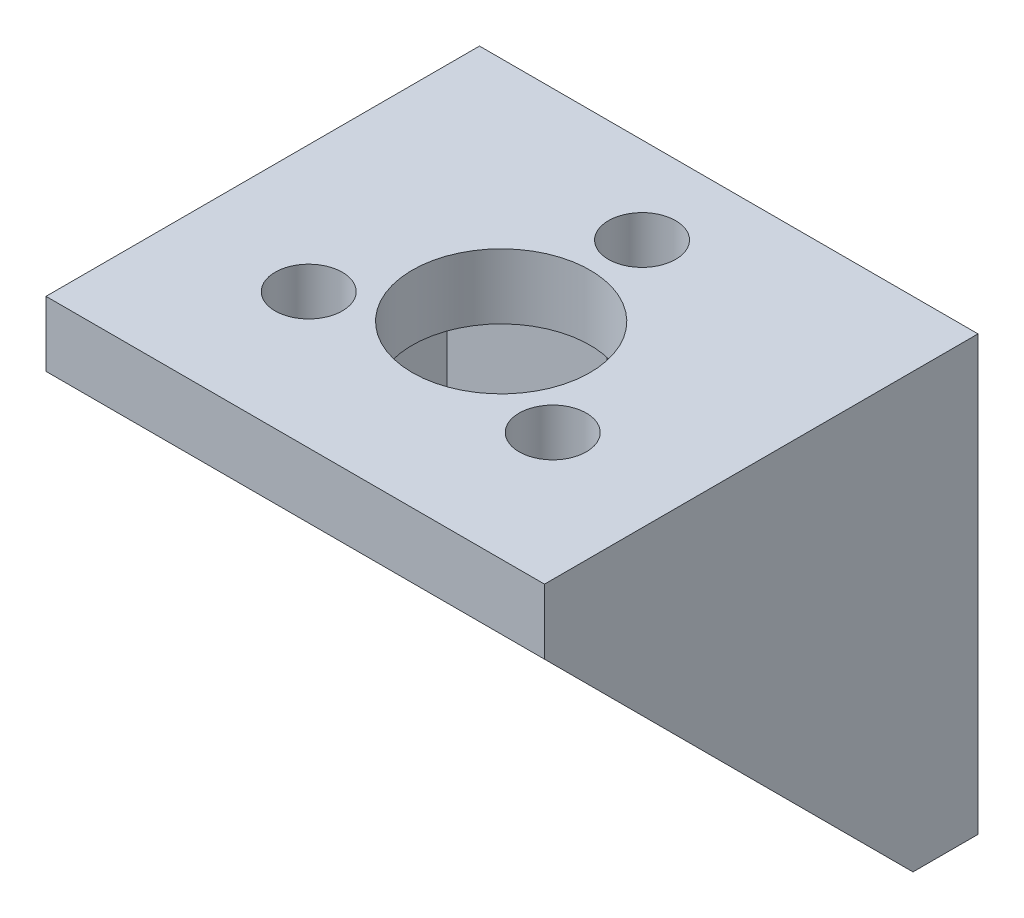
ISO-10303-21;
HEADER;
FILE_DESCRIPTION(('STEP AP214'),'2;1');
FILE_NAME('part.step','',(''),(''),'','','');
FILE_SCHEMA(('AUTOMOTIVE_DESIGN { 1 0 10303 214 1 1 1 1 }'));
ENDSEC;
DATA;
#1=APPLICATION_CONTEXT('core data for automotive mechanical design processes');
#2=APPLICATION_PROTOCOL_DEFINITION('international standard','automotive_design',2000,#1);
#3=PRODUCT_CONTEXT('',#1,'mechanical');
#4=PRODUCT('Part','Part','',(#3));
#5=PRODUCT_RELATED_PRODUCT_CATEGORY('part','',(#4));
#6=PRODUCT_DEFINITION_FORMATION('','',#4);
#7=PRODUCT_DEFINITION_CONTEXT('part definition',#1,'design');
#8=PRODUCT_DEFINITION('design','',#6,#7);
#9=PRODUCT_DEFINITION_SHAPE('','',#8);
#10=(LENGTH_UNIT() NAMED_UNIT(*) SI_UNIT(.MILLI.,.METRE.));
#11=(NAMED_UNIT(*) PLANE_ANGLE_UNIT() SI_UNIT($,.RADIAN.));
#12=(NAMED_UNIT(*) SI_UNIT($,.STERADIAN.) SOLID_ANGLE_UNIT());
#13=UNCERTAINTY_MEASURE_WITH_UNIT(LENGTH_MEASURE(1.E-05),#10,'distance_accuracy_value','');
#14=(GEOMETRIC_REPRESENTATION_CONTEXT(3) GLOBAL_UNCERTAINTY_ASSIGNED_CONTEXT((#13)) GLOBAL_UNIT_ASSIGNED_CONTEXT((#10,
#11,#12)) REPRESENTATION_CONTEXT('',''));
#15=CARTESIAN_POINT('',(0.,0.,0.));
#16=DIRECTION('',(0.,0.,1.));
#17=DIRECTION('',(1.,0.,0.));
#18=AXIS2_PLACEMENT_3D('',#15,#16,#17);
#19=CARTESIAN_POINT('',(-10.,-3.,2.99999999999999));
#20=DIRECTION('',(0.,0.,-1.));
#21=DIRECTION('',(0.,1.,0.));
#22=AXIS2_PLACEMENT_3D('',#19,#20,#21);
#23=PLANE('',#22);
#24=DIRECTION('',(0.,1.,0.));
#25=VECTOR('',#24,1.);
#26=CARTESIAN_POINT('',(-2.61533936612726,-20.,2.99999999999999));
#27=LINE('',#26,#25);
#28=CARTESIAN_POINT('',(-2.61533936612726,-3.,2.99999999999999));
#29=VERTEX_POINT('',#28);
#30=CARTESIAN_POINT('',(-2.61533936612726,-7.53030615433518,2.99999999999999));
#31=VERTEX_POINT('',#30);
#32=EDGE_CURVE('E163',#29,#31,#27,.F.);
#33=ORIENTED_EDGE('',*,*,#32,.F.);
#34=DIRECTION('',(1.,0.,0.));
#35=VECTOR('',#34,1.);
#36=CARTESIAN_POINT('',(-10.,-3.,2.99999999999999));
#37=LINE('',#36,#35);
#38=CARTESIAN_POINT('',(-10.,-3.,2.99999999999999));
#39=VERTEX_POINT('',#38);
#40=EDGE_CURVE('E173',#39,#29,#37,.T.);
#41=ORIENTED_EDGE('',*,*,#40,.F.);
#42=DIRECTION('',(0.,1.,0.));
#43=VECTOR('',#42,1.);
#44=CARTESIAN_POINT('',(-10.,-3.,2.99999999999999));
#45=LINE('',#44,#43);
#46=CARTESIAN_POINT('',(-10.,-20.,2.99999999999999));
#47=VERTEX_POINT('',#46);
#48=EDGE_CURVE('E184',#47,#39,#45,.T.);
#49=ORIENTED_EDGE('',*,*,#48,.F.);
#50=DIRECTION('',(1.,0.,0.));
#51=VECTOR('',#50,1.);
#52=CARTESIAN_POINT('',(-10.,-20.,2.99999999999999));
#53=LINE('',#52,#51);
#54=CARTESIAN_POINT('',(-2.61533936612726,-20.,2.99999999999999));
#55=VERTEX_POINT('',#54);
#56=EDGE_CURVE('E206',#47,#55,#53,.T.);
#57=ORIENTED_EDGE('',*,*,#56,.T.);
#58=CARTESIAN_POINT('',(-2.61533936612726,-13.4696938456648,2.99999999999999));
#59=VERTEX_POINT('',#58);
#60=EDGE_CURVE('E335',#59,#55,#27,.F.);
#61=ORIENTED_EDGE('',*,*,#60,.F.);
#62=CARTESIAN_POINT('',(0.,-12.,2.99999999999999));
#63=DIRECTION('',(0.,0.,1.));
#64=DIRECTION('',(1.,0.,0.));
#65=AXIS2_PLACEMENT_3D('',#62,#63,#64);
#66=CIRCLE('',#65,3.);
#67=CARTESIAN_POINT('',(-3.,-12.,2.99999999999999));
#68=VERTEX_POINT('',#67);
#69=EDGE_CURVE('E274',#68,#59,#66,.T.);
#70=ORIENTED_EDGE('',*,*,#69,.F.);
#71=DIRECTION('',(0.,-1.,0.));
#72=VECTOR('',#71,1.);
#73=CARTESIAN_POINT('',(-3.,-9.00000000000001,2.99999999999999));
#74=LINE('',#73,#72);
#75=CARTESIAN_POINT('',(-3.,-9.00000000000001,2.99999999999999));
#76=VERTEX_POINT('',#75);
#77=EDGE_CURVE('E270',#76,#68,#74,.T.);
#78=ORIENTED_EDGE('',*,*,#77,.F.);
#79=CARTESIAN_POINT('',(0.,-9.00000000000001,2.99999999999999));
#80=DIRECTION('',(0.,0.,1.));
#81=DIRECTION('',(-1.,0.,0.));
#82=AXIS2_PLACEMENT_3D('',#79,#80,#81);
#83=CIRCLE('',#82,3.);
#84=EDGE_CURVE('E267',#31,#76,#83,.T.);
#85=ORIENTED_EDGE('',*,*,#84,.F.);
#86=EDGE_LOOP('',(#33,#41,#49,#57,#61,#70,#78,#85));
#87=FACE_BOUND('',#86,.T.);
#88=ADVANCED_FACE('F35',(#87),#23,.F.);
#89=DIRECTION('',(0.,1.,0.));
#90=VECTOR('',#89,1.);
#91=CARTESIAN_POINT('',(2.61533936612251,-20.,2.99999999999999));
#92=LINE('',#91,#90);
#93=CARTESIAN_POINT('',(2.61533936612251,-20.,2.99999999999999));
#94=VERTEX_POINT('',#93);
#95=CARTESIAN_POINT('',(2.61533936612251,-13.4696938456733,2.99999999999999));
#96=VERTEX_POINT('',#95);
#97=EDGE_CURVE('E55',#94,#96,#92,.T.);
#98=ORIENTED_EDGE('',*,*,#97,.F.);
#99=CARTESIAN_POINT('',(10.,-20.,2.99999999999999));
#100=VERTEX_POINT('',#99);
#101=EDGE_CURVE('E298',#94,#100,#53,.T.);
#102=ORIENTED_EDGE('',*,*,#101,.T.);
#103=DIRECTION('',(0.,1.,0.));
#104=VECTOR('',#103,1.);
#105=CARTESIAN_POINT('',(10.,-3.,2.99999999999999));
#106=LINE('',#105,#104);
#107=CARTESIAN_POINT('',(10.,-3.,2.99999999999999));
#108=VERTEX_POINT('',#107);
#109=EDGE_CURVE('E179',#100,#108,#106,.T.);
#110=ORIENTED_EDGE('',*,*,#109,.T.);
#111=CARTESIAN_POINT('',(2.61533936612251,-3.,2.99999999999999));
#112=VERTEX_POINT('',#111);
#113=EDGE_CURVE('E170',#112,#108,#37,.T.);
#114=ORIENTED_EDGE('',*,*,#113,.F.);
#115=CARTESIAN_POINT('',(2.61533936612251,-7.53030615432673,2.99999999999999));
#116=VERTEX_POINT('',#115);
#117=EDGE_CURVE('E152',#116,#112,#92,.T.);
#118=ORIENTED_EDGE('',*,*,#117,.F.);
#119=CARTESIAN_POINT('',(3.,-9.00000000000001,2.99999999999999));
#120=VERTEX_POINT('',#119);
#121=EDGE_CURVE('E268',#120,#116,#83,.T.);
#122=ORIENTED_EDGE('',*,*,#121,.F.);
#123=DIRECTION('',(0.,1.,0.));
#124=VECTOR('',#123,1.);
#125=CARTESIAN_POINT('',(3.,-9.00000000000001,2.99999999999999));
#126=LINE('',#125,#124);
#127=CARTESIAN_POINT('',(3.,-12.,2.99999999999999));
#128=VERTEX_POINT('',#127);
#129=EDGE_CURVE('E277',#128,#120,#126,.T.);
#130=ORIENTED_EDGE('',*,*,#129,.F.);
#131=EDGE_CURVE('E273',#96,#128,#66,.T.);
#132=ORIENTED_EDGE('',*,*,#131,.F.);
#133=EDGE_LOOP('',(#98,#102,#110,#114,#118,#122,#130,#132));
#134=FACE_BOUND('',#133,.T.);
#135=ADVANCED_FACE('F177',(#134),#23,.F.);
#136=CARTESIAN_POINT('',(0.,-9.00000000000001,-0.00100000000001401));
#137=DIRECTION('',(0.,0.,1.));
#138=DIRECTION('',(1.,0.,0.));
#139=AXIS2_PLACEMENT_3D('',#136,#137,#138);
#140=CYLINDRICAL_SURFACE('',#139,3.);
#141=CARTESIAN_POINT('',(-2.61533936612726,-7.53030615433518,2.99999999999999));
#142=CARTESIAN_POINT('',(-2.59747542856097,-7.49850561741677,2.95330220462987));
#143=CARTESIAN_POINT('',(-2.57851379464496,-7.46613254468282,2.90743746889188));
#144=CARTESIAN_POINT('',(-2.53840650670679,-7.40063802992627,2.81723252724609));
#145=CARTESIAN_POINT('',(-2.51726119246264,-7.36751670495551,2.77289208558678));
#146=CARTESIAN_POINT('',(-2.45050969307646,-7.26753777274381,2.64182880506907));
#147=CARTESIAN_POINT('',(-2.40162674354896,-7.20013590685424,2.55716469268804));
#148=CARTESIAN_POINT('',(-2.29445698100345,-7.06532278223996,2.39213070076402));
#149=CARTESIAN_POINT('',(-2.23607500137279,-6.99791916420023,2.31181656639805));
#150=CARTESIAN_POINT('',(-2.11005101616704,-6.86551358218983,2.1567264184025));
#151=CARTESIAN_POINT('',(-2.04241554253215,-6.80050996482504,2.08194655506329));
#152=CARTESIAN_POINT('',(-1.92054690538042,-6.69439798449972,1.96129004864372));
#153=CARTESIAN_POINT('',(-1.86885500779155,-6.65224296769129,1.91376135663099));
#154=CARTESIAN_POINT('',(-1.76097580156191,-6.57027565648974,1.82192998943518));
#155=CARTESIAN_POINT('',(-1.70478875676577,-6.53046322483527,1.77762712520186));
#156=CARTESIAN_POINT('',(-1.52983913116511,-6.41563256789321,1.65047138610336));
#157=CARTESIAN_POINT('',(-1.40421745190329,-6.34480027021279,1.57289721626424));
#158=CARTESIAN_POINT('',(-1.16277470489214,-6.23196965368883,1.45000945681634));
#159=CARTESIAN_POINT('',(-1.05002867165253,-6.18703770819704,1.40134641008076));
#160=CARTESIAN_POINT('',(-0.815056231305466,-6.11020345713556,1.31836398461732));
#161=CARTESIAN_POINT('',(-0.692831311323901,-6.07829911258946,1.28404236126437));
#162=CARTESIAN_POINT('',(-0.441006541222111,-6.02980711680109,1.23194339623319));
#163=CARTESIAN_POINT('',(-0.311363229500622,-6.01332224931442,1.21427707000562));
#164=CARTESIAN_POINT('',(-0.0498576819741765,-5.99756099739587,1.19738511956151));
#165=CARTESIAN_POINT('',(0.0820033518729923,-5.99827557363983,1.1981498087574));
#166=CARTESIAN_POINT('',(0.328579035805798,-6.01577237632391,1.21690412290759));
#167=CARTESIAN_POINT('',(0.443578023470886,-6.03077002138789,1.23298064711366));
#168=CARTESIAN_POINT('',(0.668475699452998,-6.07318583705352,1.27854629385308));
#169=CARTESIAN_POINT('',(0.778373595247775,-6.10060593057376,1.30803749289842));
#170=CARTESIAN_POINT('',(0.995144119389187,-6.16749596300728,1.38021550366896));
#171=CARTESIAN_POINT('',(1.10171652345978,-6.20740683050749,1.42338604006991));
#172=CARTESIAN_POINT('',(1.30555101427707,-6.29667986666354,1.52042339600524));
#173=CARTESIAN_POINT('',(1.40280928221274,-6.34604588727323,1.57429457522884));
#174=CARTESIAN_POINT('',(1.63621300904152,-6.48022236822192,1.72169951424056));
#175=CARTESIAN_POINT('',(1.76577836346599,-6.56998543023953,1.82115710066822));
#176=CARTESIAN_POINT('',(2.00206939696984,-6.76061164564271,2.03597865873076));
#177=CARTESIAN_POINT('',(2.10871153469745,-6.86151343740258,2.15139837389258));
#178=CARTESIAN_POINT('',(2.24754338495268,-7.01187473801404,2.32862866200606));
#179=CARTESIAN_POINT('',(2.28862230403332,-7.05938315147973,2.3853529764831));
#180=CARTESIAN_POINT('',(2.36627006725898,-7.15485708176283,2.50145300264206));
#181=CARTESIAN_POINT('',(2.40283931414764,-7.20282255734881,2.5608284769118));
#182=CARTESIAN_POINT('',(2.47125319382366,-7.29814576605076,2.6817774095619));
#183=CARTESIAN_POINT('',(2.50313368184303,-7.34550527547302,2.7433291799884));
#184=CARTESIAN_POINT('',(2.56252003949754,-7.43903948698772,2.8693810671286));
#185=CARTESIAN_POINT('',(2.59002537689766,-7.48521404435918,2.93388154132388));
#186=CARTESIAN_POINT('',(2.61533936612251,-7.53030615432673,2.99999999999999));
#187=B_SPLINE_CURVE_WITH_KNOTS('',3,(#141,#142,#143,#144,#145,#146,#147,#148,#149,#150,#151,
#152,#153,#154,#155,#156,#157,#158,#159,#160,#161,#162,#163,#164,#165,#166,#167,#168,#169,#170,
#171,#172,#173,#174,#175,#176,#177,#178,#179,#180,#181,#182,#183,#184,#185,#186),.UNSPECIFIED.,
.F.,.F.,(4,2,2,2,2,2,2,2,2,2,2,2,2,2,2,2,2,2,2,2,2,2,4),(0.,0.177713779753218,0.355399949003304,
0.711157887540579,1.07072847599698,1.43004654463001,1.6755439945833,1.92102704551354,
2.40964800102648,2.80042056248315,3.19113193986379,3.58442955491477,3.97752047334098,
4.3271656179758,4.67686490403032,5.04065183009591,5.40458727650062,5.96067204041029,
6.51875027257026,6.77251593413066,7.0262589162962,7.27794749117537,7.52966666047389),.UNSPECIFIED.);
#188=EDGE_CURVE('E158',#31,#116,#187,.T.);
#189=ORIENTED_EDGE('',*,*,#188,.F.);
#190=ORIENTED_EDGE('',*,*,#84,.T.);
#191=DIRECTION('',(0.,0.,1.));
#192=VECTOR('',#191,1.);
#193=CARTESIAN_POINT('',(-3.,-9.00000000000001,-0.00100000000001401));
#194=LINE('',#193,#192);
#195=CARTESIAN_POINT('',(-3.,-9.00000000000001,0.));
#196=VERTEX_POINT('',#195);
#197=EDGE_CURVE('E280',#196,#76,#194,.T.);
#198=ORIENTED_EDGE('',*,*,#197,.F.);
#199=CARTESIAN_POINT('',(0.,-9.00000000000001,0.));
#200=DIRECTION('',(0.,0.,1.));
#201=DIRECTION('',(0.,-1.,0.));
#202=AXIS2_PLACEMENT_3D('',#199,#200,#201);
#203=CIRCLE('',#202,3.);
#204=CARTESIAN_POINT('',(3.,-9.00000000000001,0.));
#205=VERTEX_POINT('',#204);
#206=EDGE_CURVE('E264',#196,#205,#203,.F.);
#207=ORIENTED_EDGE('',*,*,#206,.T.);
#208=DIRECTION('',(0.,0.,1.));
#209=VECTOR('',#208,1.);
#210=CARTESIAN_POINT('',(3.,-9.00000000000001,-0.00100000000001401));
#211=LINE('',#210,#209);
#212=EDGE_CURVE('E281',#205,#120,#211,.T.);
#213=ORIENTED_EDGE('',*,*,#212,.T.);
#214=ORIENTED_EDGE('',*,*,#121,.T.);
#215=EDGE_LOOP('',(#189,#190,#198,#207,#213,#214));
#216=FACE_BOUND('',#215,.T.);
#217=ADVANCED_FACE('F364',(#216),#140,.F.);
#218=CARTESIAN_POINT('',(0.,-12.,-0.00100000000001401));
#219=DIRECTION('',(0.,0.,1.));
#220=DIRECTION('',(1.,0.,0.));
#221=AXIS2_PLACEMENT_3D('',#218,#219,#220);
#222=CYLINDRICAL_SURFACE('',#221,3.);
#223=CARTESIAN_POINT('',(2.61533936612251,-13.4696938456733,2.99999999999999));
#224=CARTESIAN_POINT('',(2.59747542855618,-13.5014943825915,2.95330220462976));
#225=CARTESIAN_POINT('',(2.57851379464012,-13.5338674553253,2.90743746889166));
#226=CARTESIAN_POINT('',(2.53840650670185,-13.5993619700816,2.81723252724567));
#227=CARTESIAN_POINT('',(2.51726119245764,-13.6324832950522,2.77289208558628));
#228=CARTESIAN_POINT('',(2.4505096930713,-13.7324622272635,2.6418288050683));
#229=CARTESIAN_POINT('',(2.40162674354367,-13.7998640931528,2.55716469268712));
#230=CARTESIAN_POINT('',(2.29445698099788,-13.9346772177666,2.39213070076284));
#231=CARTESIAN_POINT('',(2.23607500136708,-14.0020808358062,2.31181656639676));
#232=CARTESIAN_POINT('',(2.11005101616102,-14.1344864178161,2.15672641840103));
#233=CARTESIAN_POINT('',(2.04241554252596,-14.1994900351807,2.08194655506176));
#234=CARTESIAN_POINT('',(1.92054690537403,-14.3056020155056,1.96129004864217));
#235=CARTESIAN_POINT('',(1.86885500778511,-14.3477570323138,1.91376135662948));
#236=CARTESIAN_POINT('',(1.7609758015554,-14.429724343515,1.82192998943375));
#237=CARTESIAN_POINT('',(1.70478875675924,-14.4695367751692,1.77762712520048));
#238=CARTESIAN_POINT('',(1.5298391311585,-14.5843674321107,1.65047138610215));
#239=CARTESIAN_POINT('',(1.40421745189665,-14.6551997297907,1.57289721626315));
#240=CARTESIAN_POINT('',(1.16277470488548,-14.768030346314,1.45000945681546));
#241=CARTESIAN_POINT('',(1.05002867164586,-14.8129622918055,1.40134641007999));
#242=CARTESIAN_POINT('',(0.815056231298844,-14.8897965428663,1.31836398461675));
#243=CARTESIAN_POINT('',(0.692831311317323,-14.9217008874121,1.2840423612639));
#244=CARTESIAN_POINT('',(0.44100654121568,-14.9701928831999,1.23194339623293));
#245=CARTESIAN_POINT('',(0.311363229494295,-14.9866777506862,1.21427707000545));
#246=CARTESIAN_POINT('',(0.0498576819681064,-15.0024390026042,1.19738511956149));
#247=CARTESIAN_POINT('',(-0.0820033518789091,-15.00172442636,1.19814980875744));
#248=CARTESIAN_POINT('',(-0.328579035811493,-14.9842276236755,1.2169041229077));
#249=CARTESIAN_POINT('',(-0.443578023476514,-14.9692299786113,1.23298064711381));
#250=CARTESIAN_POINT('',(-0.668475699458472,-14.9268141629452,1.27854629385326));
#251=CARTESIAN_POINT('',(-0.778373595253162,-14.8993940694248,1.30803749289861));
#252=CARTESIAN_POINT('',(-0.99514411939448,-14.8325040369909,1.38021550366916));
#253=CARTESIAN_POINT('',(-1.10171652346506,-14.7925931694904,1.42338604007014));
#254=CARTESIAN_POINT('',(-1.30555101428231,-14.7033201333339,1.5204233960055));
#255=CARTESIAN_POINT('',(-1.40280928221794,-14.653954112724,1.5742945752291));
#256=CARTESIAN_POINT('',(-1.63621300904676,-14.5197776317747,1.7216995142409));
#257=CARTESIAN_POINT('',(-1.76577836347126,-14.4300145697567,1.82115710066864));
#258=CARTESIAN_POINT('',(-2.00206939697512,-14.2393883543526,2.03597865873131));
#259=CARTESIAN_POINT('',(-2.10871153470272,-14.1384865625923,2.15139837389318));
#260=CARTESIAN_POINT('',(-2.24754338495787,-13.9881252619801,2.32862866200666));
#261=CARTESIAN_POINT('',(-2.28862230403847,-13.9406168485142,2.38535297648367));
#262=CARTESIAN_POINT('',(-2.36627006726405,-13.8451429182307,2.50145300264257));
#263=CARTESIAN_POINT('',(-2.40283931415266,-13.7971774426445,2.56082847691227));
#264=CARTESIAN_POINT('',(-2.4712531938286,-13.7018542339421,2.68177740956226));
#265=CARTESIAN_POINT('',(-2.50313368184793,-13.6544947245196,2.74332917998871));
#266=CARTESIAN_POINT('',(-2.56252003950235,-13.5609605130044,2.86938106712876));
#267=CARTESIAN_POINT('',(-2.59002537690244,-13.5147859556327,2.93388154132397));
#268=CARTESIAN_POINT('',(-2.61533936612726,-13.4696938456648,2.99999999999999));
#269=B_SPLINE_CURVE_WITH_KNOTS('',3,(#223,#224,#225,#226,#227,#228,#229,#230,#231,#232,#233,
#234,#235,#236,#237,#238,#239,#240,#241,#242,#243,#244,#245,#246,#247,#248,#249,#250,#251,#252,
#253,#254,#255,#256,#257,#258,#259,#260,#261,#262,#263,#264,#265,#266,#267,#268),.UNSPECIFIED.,
.F.,.F.,(4,2,2,2,2,2,2,2,2,2,2,2,2,2,2,2,2,2,2,2,2,2,4),(0.,0.177713779753254,0.355399949003374,
0.711157887540714,1.07072847599718,1.43004654463027,1.67554399458325,1.92102704551317,
2.4096480010255,2.80042056248174,3.19113193986195,3.58442955491248,3.97752047333825,
4.32716561797297,4.67686490402738,5.04065183009318,5.4045872764981,5.96067204040858,
6.51875027256937,6.77251593412999,7.02625891629577,7.27794749117515,7.5296666604739),.UNSPECIFIED.);
#270=EDGE_CURVE('E11',#96,#59,#269,.T.);
#271=ORIENTED_EDGE('',*,*,#270,.F.);
#272=ORIENTED_EDGE('',*,*,#131,.T.);
#273=DIRECTION('',(0.,0.,1.));
#274=VECTOR('',#273,1.);
#275=CARTESIAN_POINT('',(3.,-12.,-0.00100000000001401));
#276=LINE('',#275,#274);
#277=CARTESIAN_POINT('',(3.,-12.,0.));
#278=VERTEX_POINT('',#277);
#279=EDGE_CURVE('E284',#278,#128,#276,.T.);
#280=ORIENTED_EDGE('',*,*,#279,.F.);
#281=CARTESIAN_POINT('',(0.,-12.,0.));
#282=DIRECTION('',(0.,0.,1.));
#283=DIRECTION('',(0.,-1.,0.));
#284=AXIS2_PLACEMENT_3D('',#281,#282,#283);
#285=CIRCLE('',#284,3.);
#286=CARTESIAN_POINT('',(-3.,-12.,0.));
#287=VERTEX_POINT('',#286);
#288=EDGE_CURVE('E63',#278,#287,#285,.F.);
#289=ORIENTED_EDGE('',*,*,#288,.T.);
#290=DIRECTION('',(0.,0.,1.));
#291=VECTOR('',#290,1.);
#292=CARTESIAN_POINT('',(-3.,-12.,-0.00100000000001401));
#293=LINE('',#292,#291);
#294=EDGE_CURVE('E287',#287,#68,#293,.T.);
#295=ORIENTED_EDGE('',*,*,#294,.T.);
#296=ORIENTED_EDGE('',*,*,#69,.T.);
#297=EDGE_LOOP('',(#271,#272,#280,#289,#295,#296));
#298=FACE_BOUND('',#297,.T.);
#299=ADVANCED_FACE('F382',(#298),#222,.F.);
#300=CARTESIAN_POINT('',(-2.37310171513627E-12,-20.,3.99999999999873));
#301=DIRECTION('',(0.,1.,0.));
#302=DIRECTION('',(0.,0.,1.));
#303=AXIS2_PLACEMENT_3D('',#300,#301,#302);
#304=CYLINDRICAL_SURFACE('',#303,1.55);
#305=CARTESIAN_POINT('',(-2.37310171513627E-12,0.,3.99999999999873));
#306=DIRECTION('',(0.,1.,0.));
#307=DIRECTION('',(0.,0.,1.));
#308=AXIS2_PLACEMENT_3D('',#305,#306,#307);
#309=CIRCLE('',#308,1.55);
#310=CARTESIAN_POINT('',(-2.37310171513627E-12,0.,5.54999999999873));
#311=VERTEX_POINT('',#310);
#312=EDGE_CURVE('E240',#311,#311,#309,.T.);
#313=ORIENTED_EDGE('',*,*,#312,.T.);
#314=EDGE_LOOP('',(#313));
#315=FACE_BOUND('',#314,.T.);
#316=CARTESIAN_POINT('',(-2.37310171513627E-12,-3.,3.99999999999873));
#317=DIRECTION('',(0.,1.,0.));
#318=DIRECTION('',(0.,0.,1.));
#319=AXIS2_PLACEMENT_3D('',#316,#317,#318);
#320=CIRCLE('',#319,1.55);
#321=CARTESIAN_POINT('',(-2.37310171513627E-12,-3.,5.54999999999873));
#322=VERTEX_POINT('',#321);
#323=EDGE_CURVE('E244',#322,#322,#320,.T.);
#324=ORIENTED_EDGE('',*,*,#323,.F.);
#325=EDGE_LOOP('',(#324));
#326=FACE_BOUND('',#325,.T.);
#327=ADVANCED_FACE('F378',(#315,#326),#304,.F.);
#328=CARTESIAN_POINT('',(11.5,-20.,2.99999999999999));
#329=DIRECTION('',(0.,0.707106781186548,-0.707106781186547));
#330=DIRECTION('',(0.,0.707106781186547,0.707106781186548));
#331=AXIS2_PLACEMENT_3D('',#328,#329,#330);
#332=PLANE('',#331);
#333=DIRECTION('',(0.,0.707106781186547,0.707106781186548));
#334=VECTOR('',#333,1.);
#335=CARTESIAN_POINT('',(10.,-20.,2.99999999999999));
#336=LINE('',#335,#334);
#337=CARTESIAN_POINT('',(10.,-3.,20.));
#338=VERTEX_POINT('',#337);
#339=EDGE_CURVE('E231',#100,#338,#336,.T.);
#340=ORIENTED_EDGE('',*,*,#339,.F.);
#341=DIRECTION('',(-1.,0.,0.));
#342=VECTOR('',#341,1.);
#343=CARTESIAN_POINT('',(11.5,-20.,2.99999999999999));
#344=LINE('',#343,#342);
#345=CARTESIAN_POINT('',(11.5,-20.,2.99999999999999));
#346=VERTEX_POINT('',#345);
#347=EDGE_CURVE('E218',#346,#100,#344,.T.);
#348=ORIENTED_EDGE('',*,*,#347,.F.);
#349=DIRECTION('',(0.,-0.707106781186548,-0.707106781186548));
#350=VECTOR('',#349,1.);
#351=CARTESIAN_POINT('',(11.5,-3.,20.));
#352=LINE('',#351,#350);
#353=CARTESIAN_POINT('',(11.5,-3.,20.));
#354=VERTEX_POINT('',#353);
#355=EDGE_CURVE('E197',#354,#346,#352,.T.);
#356=ORIENTED_EDGE('',*,*,#355,.F.);
#357=DIRECTION('',(-1.,0.,0.));
#358=VECTOR('',#357,1.);
#359=CARTESIAN_POINT('',(11.5,-3.,20.));
#360=LINE('',#359,#358);
#361=EDGE_CURVE('E222',#354,#338,#360,.T.);
#362=ORIENTED_EDGE('',*,*,#361,.T.);
#363=EDGE_LOOP('',(#340,#348,#356,#362));
#364=FACE_BOUND('',#363,.T.);
#365=ADVANCED_FACE('F312',(#364),#332,.F.);
#366=CARTESIAN_POINT('',(11.5,0.,0.));
#367=DIRECTION('',(0.,0.,1.));
#368=DIRECTION('',(0.,-1.,0.));
#369=AXIS2_PLACEMENT_3D('',#366,#367,#368);
#370=PLANE('',#369);
#371=DIRECTION('',(0.,-1.,0.));
#372=VECTOR('',#371,1.);
#373=CARTESIAN_POINT('',(3.,-9.00000000000001,0.));
#374=LINE('',#373,#372);
#375=EDGE_CURVE('E261',#205,#278,#374,.T.);
#376=ORIENTED_EDGE('',*,*,#375,.F.);
#377=ORIENTED_EDGE('',*,*,#206,.F.);
#378=DIRECTION('',(0.,1.,0.));
#379=VECTOR('',#378,1.);
#380=CARTESIAN_POINT('',(-3.,-9.00000000000001,0.));
#381=LINE('',#380,#379);
#382=EDGE_CURVE('E283',#287,#196,#381,.T.);
#383=ORIENTED_EDGE('',*,*,#382,.F.);
#384=ORIENTED_EDGE('',*,*,#288,.F.);
#385=EDGE_LOOP('',(#376,#377,#383,#384));
#386=FACE_BOUND('',#385,.T.);
#387=DIRECTION('',(0.,1.,0.));
#388=VECTOR('',#387,1.);
#389=CARTESIAN_POINT('',(-11.5,0.,0.));
#390=LINE('',#389,#388);
#391=CARTESIAN_POINT('',(-11.5,-20.,0.));
#392=VERTEX_POINT('',#391);
#393=CARTESIAN_POINT('',(-11.5,0.,0.));
#394=VERTEX_POINT('',#393);
#395=EDGE_CURVE('E202',#392,#394,#390,.T.);
#396=ORIENTED_EDGE('',*,*,#395,.T.);
#397=DIRECTION('',(-1.,0.,0.));
#398=VECTOR('',#397,1.);
#399=CARTESIAN_POINT('',(11.5,0.,0.));
#400=LINE('',#399,#398);
#401=CARTESIAN_POINT('',(11.5,0.,0.));
#402=VERTEX_POINT('',#401);
#403=EDGE_CURVE('E228',#402,#394,#400,.T.);
#404=ORIENTED_EDGE('',*,*,#403,.F.);
#405=DIRECTION('',(0.,1.,0.));
#406=VECTOR('',#405,1.);
#407=CARTESIAN_POINT('',(11.5,0.,0.));
#408=LINE('',#407,#406);
#409=CARTESIAN_POINT('',(11.5,-20.,0.));
#410=VERTEX_POINT('',#409);
#411=EDGE_CURVE('E189',#410,#402,#408,.T.);
#412=ORIENTED_EDGE('',*,*,#411,.F.);
#413=DIRECTION('',(-1.,0.,0.));
#414=VECTOR('',#413,1.);
#415=CARTESIAN_POINT('',(11.5,-20.,0.));
#416=LINE('',#415,#414);
#417=EDGE_CURVE('E201',#410,#392,#416,.T.);
#418=ORIENTED_EDGE('',*,*,#417,.T.);
#419=EDGE_LOOP('',(#396,#404,#412,#418));
#420=FACE_BOUND('',#419,.T.);
#421=ADVANCED_FACE('F37',(#386,#420),#370,.F.);
#422=CARTESIAN_POINT('',(11.5,0.,0.));
#423=DIRECTION('',(0.,-1.,0.));
#424=DIRECTION('',(0.,0.,-1.));
#425=AXIS2_PLACEMENT_3D('',#422,#423,#424);
#426=PLANE('',#425);
#427=CARTESIAN_POINT('',(5.62916512459646,0.,13.7499999999988));
#428=DIRECTION('',(0.,1.,0.));
#429=DIRECTION('',(-0.866025403784436,0.,-0.500000000000004));
#430=AXIS2_PLACEMENT_3D('',#427,#428,#429);
#431=CIRCLE('',#430,1.55);
#432=CARTESIAN_POINT('',(4.28682574873059,0.,12.9749999999988));
#433=VERTEX_POINT('',#432);
#434=EDGE_CURVE('E238',#433,#433,#431,.T.);
#435=ORIENTED_EDGE('',*,*,#434,.F.);
#436=EDGE_LOOP('',(#435));
#437=FACE_BOUND('',#436,.T.);
#438=CARTESIAN_POINT('',(-5.62916512460126,0.,13.7499999999987));
#439=DIRECTION('',(0.,1.,0.));
#440=DIRECTION('',(0.866025403784443,0.,-0.499999999999992));
#441=AXIS2_PLACEMENT_3D('',#438,#439,#440);
#442=CIRCLE('',#441,1.55);
#443=CARTESIAN_POINT('',(-4.28682574873537,0.,12.9749999999987));
#444=VERTEX_POINT('',#443);
#445=EDGE_CURVE('E252',#444,#444,#442,.T.);
#446=ORIENTED_EDGE('',*,*,#445,.F.);
#447=EDGE_LOOP('',(#446));
#448=FACE_BOUND('',#447,.T.);
#449=ORIENTED_EDGE('',*,*,#312,.F.);
#450=EDGE_LOOP('',(#449));
#451=FACE_BOUND('',#450,.T.);
#452=CARTESIAN_POINT('',(-2.37310171513627E-12,0.,10.4999999999987));
#453=DIRECTION('',(0.,1.,0.));
#454=DIRECTION('',(0.,0.,1.));
#455=AXIS2_PLACEMENT_3D('',#452,#453,#454);
#456=CIRCLE('',#455,4.1);
#457=CARTESIAN_POINT('',(-2.37310171513627E-12,0.,14.5999999999987));
#458=VERTEX_POINT('',#457);
#459=EDGE_CURVE('E249',#458,#458,#456,.T.);
#460=ORIENTED_EDGE('',*,*,#459,.F.);
#461=EDGE_LOOP('',(#460));
#462=FACE_BOUND('',#461,.T.);
#463=DIRECTION('',(0.,0.,1.));
#464=VECTOR('',#463,1.);
#465=CARTESIAN_POINT('',(-11.5,0.,0.));
#466=LINE('',#465,#464);
#467=CARTESIAN_POINT('',(-11.5,0.,20.));
#468=VERTEX_POINT('',#467);
#469=EDGE_CURVE('E205',#394,#468,#466,.T.);
#470=ORIENTED_EDGE('',*,*,#469,.T.);
#471=DIRECTION('',(-1.,0.,0.));
#472=VECTOR('',#471,1.);
#473=CARTESIAN_POINT('',(11.5,0.,20.));
#474=LINE('',#473,#472);
#475=CARTESIAN_POINT('',(11.5,0.,20.));
#476=VERTEX_POINT('',#475);
#477=EDGE_CURVE('E225',#476,#468,#474,.T.);
#478=ORIENTED_EDGE('',*,*,#477,.F.);
#479=DIRECTION('',(0.,0.,1.));
#480=VECTOR('',#479,1.);
#481=CARTESIAN_POINT('',(11.5,0.,0.));
#482=LINE('',#481,#480);
#483=EDGE_CURVE('E192',#402,#476,#482,.T.);
#484=ORIENTED_EDGE('',*,*,#483,.F.);
#485=ORIENTED_EDGE('',*,*,#403,.T.);
#486=EDGE_LOOP('',(#470,#478,#484,#485));
#487=FACE_BOUND('',#486,.T.);
#488=ADVANCED_FACE('F348',(#437,#448,#451,#462,#487),#426,.F.);
#489=CARTESIAN_POINT('',(11.5,0.,20.));
#490=DIRECTION('',(0.,0.,-1.));
#491=DIRECTION('',(-1.,0.,0.));
#492=AXIS2_PLACEMENT_3D('',#489,#490,#491);
#493=PLANE('',#492);
#494=DIRECTION('',(0.,-1.,0.));
#495=VECTOR('',#494,1.);
#496=CARTESIAN_POINT('',(-11.5,0.,20.));
#497=LINE('',#496,#495);
#498=CARTESIAN_POINT('',(-11.5,-3.,20.));
#499=VERTEX_POINT('',#498);
#500=EDGE_CURVE('E208',#468,#499,#497,.T.);
#501=ORIENTED_EDGE('',*,*,#500,.T.);
#502=CARTESIAN_POINT('',(-10.,-3.,20.));
#503=VERTEX_POINT('',#502);
#504=EDGE_CURVE('E221',#503,#499,#360,.T.);
#505=ORIENTED_EDGE('',*,*,#504,.F.);
#506=DIRECTION('',(1.,0.,0.));
#507=VECTOR('',#506,1.);
#508=CARTESIAN_POINT('',(-10.,-3.,20.));
#509=LINE('',#508,#507);
#510=EDGE_CURVE('E182',#503,#338,#509,.T.);
#511=ORIENTED_EDGE('',*,*,#510,.T.);
#512=ORIENTED_EDGE('',*,*,#361,.F.);
#513=DIRECTION('',(0.,-1.,0.));
#514=VECTOR('',#513,1.);
#515=CARTESIAN_POINT('',(11.5,0.,20.));
#516=LINE('',#515,#514);
#517=EDGE_CURVE('E195',#476,#354,#516,.T.);
#518=ORIENTED_EDGE('',*,*,#517,.F.);
#519=ORIENTED_EDGE('',*,*,#477,.T.);
#520=EDGE_LOOP('',(#501,#505,#511,#512,#518,#519));
#521=FACE_BOUND('',#520,.T.);
#522=ADVANCED_FACE('F307',(#521),#493,.F.);
#523=CARTESIAN_POINT('',(-11.5,-20.,2.99999999999999));
#524=VERTEX_POINT('',#523);
#525=EDGE_CURVE('E217',#47,#524,#344,.T.);
#526=ORIENTED_EDGE('',*,*,#525,.F.);
#527=DIRECTION('',(0.,0.707106781186547,0.707106781186548));
#528=VECTOR('',#527,1.);
#529=CARTESIAN_POINT('',(-10.,-20.,2.99999999999999));
#530=LINE('',#529,#528);
#531=EDGE_CURVE('E49',#47,#503,#530,.T.);
#532=ORIENTED_EDGE('',*,*,#531,.T.);
#533=ORIENTED_EDGE('',*,*,#504,.T.);
#534=DIRECTION('',(0.,-0.707106781186547,-0.707106781186548));
#535=VECTOR('',#534,1.);
#536=CARTESIAN_POINT('',(-11.5,-20.,2.99999999999999));
#537=LINE('',#536,#535);
#538=EDGE_CURVE('E211',#499,#524,#537,.T.);
#539=ORIENTED_EDGE('',*,*,#538,.T.);
#540=EDGE_LOOP('',(#526,#532,#533,#539));
#541=FACE_BOUND('',#540,.T.);
#542=ADVANCED_FACE('F328',(#541),#332,.F.);
#543=CARTESIAN_POINT('',(11.5,-20.,0.));
#544=DIRECTION('',(0.,1.,0.));
#545=DIRECTION('',(0.,0.,1.));
#546=AXIS2_PLACEMENT_3D('',#543,#544,#545);
#547=PLANE('',#546);
#548=CARTESIAN_POINT('',(-2.37310171513627E-12,-20.,3.99999999999873));
#549=DIRECTION('',(0.,-1.,0.));
#550=DIRECTION('',(0.,0.,-1.));
#551=AXIS2_PLACEMENT_3D('',#548,#549,#550);
#552=CIRCLE('',#551,2.8);
#553=EDGE_CURVE('E174',#55,#94,#552,.T.);
#554=ORIENTED_EDGE('',*,*,#553,.F.);
#555=ORIENTED_EDGE('',*,*,#56,.F.);
#556=ORIENTED_EDGE('',*,*,#525,.T.);
#557=DIRECTION('',(0.,0.,-1.));
#558=VECTOR('',#557,1.);
#559=CARTESIAN_POINT('',(-11.5,-20.,0.));
#560=LINE('',#559,#558);
#561=EDGE_CURVE('E193',#524,#392,#560,.T.);
#562=ORIENTED_EDGE('',*,*,#561,.T.);
#563=ORIENTED_EDGE('',*,*,#417,.F.);
#564=DIRECTION('',(0.,0.,-1.));
#565=VECTOR('',#564,1.);
#566=CARTESIAN_POINT('',(11.5,-20.,0.));
#567=LINE('',#566,#565);
#568=EDGE_CURVE('E199',#346,#410,#567,.T.);
#569=ORIENTED_EDGE('',*,*,#568,.F.);
#570=ORIENTED_EDGE('',*,*,#347,.T.);
#571=ORIENTED_EDGE('',*,*,#101,.F.);
#572=EDGE_LOOP('',(#554,#555,#556,#562,#563,#569,#570,#571));
#573=FACE_BOUND('',#572,.T.);
#574=ADVANCED_FACE('F344',(#573),#547,.F.);
#575=CARTESIAN_POINT('',(11.5,0.,0.));
#576=DIRECTION('',(-1.,0.,0.));
#577=DIRECTION('',(0.,0.,1.));
#578=AXIS2_PLACEMENT_3D('',#575,#576,#577);
#579=PLANE('',#578);
#580=ORIENTED_EDGE('',*,*,#411,.T.);
#581=ORIENTED_EDGE('',*,*,#483,.T.);
#582=ORIENTED_EDGE('',*,*,#517,.T.);
#583=ORIENTED_EDGE('',*,*,#355,.T.);
#584=ORIENTED_EDGE('',*,*,#568,.T.);
#585=EDGE_LOOP('',(#580,#581,#582,#583,#584));
#586=FACE_BOUND('',#585,.T.);
#587=ADVANCED_FACE('F316',(#586),#579,.F.);
#588=CARTESIAN_POINT('',(-11.5,0.,0.));
#589=DIRECTION('',(-1.,0.,0.));
#590=DIRECTION('',(0.,0.,1.));
#591=AXIS2_PLACEMENT_3D('',#588,#589,#590);
#592=PLANE('',#591);
#593=ORIENTED_EDGE('',*,*,#395,.F.);
#594=ORIENTED_EDGE('',*,*,#561,.F.);
#595=ORIENTED_EDGE('',*,*,#538,.F.);
#596=ORIENTED_EDGE('',*,*,#500,.F.);
#597=ORIENTED_EDGE('',*,*,#469,.F.);
#598=EDGE_LOOP('',(#593,#594,#595,#596,#597));
#599=FACE_BOUND('',#598,.T.);
#600=ADVANCED_FACE('F324',(#599),#592,.T.);
#601=CARTESIAN_POINT('',(-10.,0.,0.));
#602=DIRECTION('',(-1.,0.,0.));
#603=DIRECTION('',(0.,0.,1.));
#604=AXIS2_PLACEMENT_3D('',#601,#602,#603);
#605=PLANE('',#604);
#606=ORIENTED_EDGE('',*,*,#48,.T.);
#607=DIRECTION('',(0.,0.,1.));
#608=VECTOR('',#607,1.);
#609=CARTESIAN_POINT('',(-10.,-3.,2.99999999999999));
#610=LINE('',#609,#608);
#611=EDGE_CURVE('E180',#39,#503,#610,.T.);
#612=ORIENTED_EDGE('',*,*,#611,.T.);
#613=ORIENTED_EDGE('',*,*,#531,.F.);
#614=EDGE_LOOP('',(#606,#612,#613));
#615=FACE_BOUND('',#614,.T.);
#616=ADVANCED_FACE('F331',(#615),#605,.F.);
#617=CARTESIAN_POINT('',(10.,0.,0.));
#618=DIRECTION('',(-1.,0.,0.));
#619=DIRECTION('',(0.,0.,1.));
#620=AXIS2_PLACEMENT_3D('',#617,#618,#619);
#621=PLANE('',#620);
#622=ORIENTED_EDGE('',*,*,#339,.T.);
#623=DIRECTION('',(0.,0.,1.));
#624=VECTOR('',#623,1.);
#625=CARTESIAN_POINT('',(10.,-3.,2.99999999999999));
#626=LINE('',#625,#624);
#627=EDGE_CURVE('E294',#108,#338,#626,.T.);
#628=ORIENTED_EDGE('',*,*,#627,.F.);
#629=ORIENTED_EDGE('',*,*,#109,.F.);
#630=EDGE_LOOP('',(#622,#628,#629));
#631=FACE_BOUND('',#630,.T.);
#632=ADVANCED_FACE('F432',(#631),#621,.T.);
#633=CARTESIAN_POINT('',(-10.,-3.,2.99999999999999));
#634=DIRECTION('',(0.,1.,0.));
#635=DIRECTION('',(0.,0.,1.));
#636=AXIS2_PLACEMENT_3D('',#633,#634,#635);
#637=PLANE('',#636);
#638=ORIENTED_EDGE('',*,*,#40,.T.);
#639=CARTESIAN_POINT('',(-2.37310171513627E-12,-3.,3.99999999999873));
#640=DIRECTION('',(0.,-1.,0.));
#641=DIRECTION('',(0.,0.,-1.));
#642=AXIS2_PLACEMENT_3D('',#639,#640,#641);
#643=CIRCLE('',#642,2.8);
#644=EDGE_CURVE('E155',#29,#112,#643,.T.);
#645=ORIENTED_EDGE('',*,*,#644,.T.);
#646=ORIENTED_EDGE('',*,*,#113,.T.);
#647=ORIENTED_EDGE('',*,*,#627,.T.);
#648=ORIENTED_EDGE('',*,*,#510,.F.);
#649=ORIENTED_EDGE('',*,*,#611,.F.);
#650=EDGE_LOOP('',(#638,#645,#646,#647,#648,#649));
#651=FACE_BOUND('',#650,.T.);
#652=ORIENTED_EDGE('',*,*,#323,.T.);
#653=EDGE_LOOP('',(#652));
#654=FACE_BOUND('',#653,.T.);
#655=CARTESIAN_POINT('',(-2.37310171513627E-12,-3.,10.4999999999987));
#656=DIRECTION('',(0.,1.,0.));
#657=DIRECTION('',(0.,0.,1.));
#658=AXIS2_PLACEMENT_3D('',#655,#656,#657);
#659=CIRCLE('',#658,4.1);
#660=CARTESIAN_POINT('',(-2.37310171513627E-12,-3.,14.5999999999987));
#661=VERTEX_POINT('',#660);
#662=EDGE_CURVE('E257',#661,#661,#659,.F.);
#663=ORIENTED_EDGE('',*,*,#662,.F.);
#664=EDGE_LOOP('',(#663));
#665=FACE_BOUND('',#664,.T.);
#666=CARTESIAN_POINT('',(5.62916512459646,-3.,13.7499999999988));
#667=DIRECTION('',(0.,1.,0.));
#668=DIRECTION('',(0.,0.,1.));
#669=AXIS2_PLACEMENT_3D('',#666,#667,#668);
#670=CIRCLE('',#669,1.55);
#671=CARTESIAN_POINT('',(5.62916512459646,-3.,15.2999999999988));
#672=VERTEX_POINT('',#671);
#673=EDGE_CURVE('E237',#672,#672,#670,.T.);
#674=ORIENTED_EDGE('',*,*,#673,.T.);
#675=EDGE_LOOP('',(#674));
#676=FACE_BOUND('',#675,.T.);
#677=CARTESIAN_POINT('',(-5.62916512460126,-3.,13.7499999999987));
#678=DIRECTION('',(0.,1.,0.));
#679=DIRECTION('',(0.,0.,1.));
#680=AXIS2_PLACEMENT_3D('',#677,#678,#679);
#681=CIRCLE('',#680,1.55);
#682=CARTESIAN_POINT('',(-5.62916512460126,-3.,15.2999999999987));
#683=VERTEX_POINT('',#682);
#684=EDGE_CURVE('E235',#683,#683,#681,.T.);
#685=ORIENTED_EDGE('',*,*,#684,.T.);
#686=EDGE_LOOP('',(#685));
#687=FACE_BOUND('',#686,.T.);
#688=ADVANCED_FACE('F167',(#651,#654,#665,#676,#687),#637,.F.);
#689=CARTESIAN_POINT('',(3.,-9.00000000000001,-0.00100000000001401));
#690=DIRECTION('',(1.,0.,0.));
#691=DIRECTION('',(0.,1.,0.));
#692=AXIS2_PLACEMENT_3D('',#689,#690,#691);
#693=PLANE('',#692);
#694=ORIENTED_EDGE('',*,*,#375,.T.);
#695=ORIENTED_EDGE('',*,*,#279,.T.);
#696=ORIENTED_EDGE('',*,*,#129,.T.);
#697=ORIENTED_EDGE('',*,*,#212,.F.);
#698=EDGE_LOOP('',(#694,#695,#696,#697));
#699=FACE_BOUND('',#698,.T.);
#700=ADVANCED_FACE('F397',(#699),#693,.F.);
#701=CARTESIAN_POINT('',(-3.,-9.00000000000001,-0.00100000000001401));
#702=DIRECTION('',(-1.,0.,0.));
#703=DIRECTION('',(0.,-1.,0.));
#704=AXIS2_PLACEMENT_3D('',#701,#702,#703);
#705=PLANE('',#704);
#706=ORIENTED_EDGE('',*,*,#382,.T.);
#707=ORIENTED_EDGE('',*,*,#197,.T.);
#708=ORIENTED_EDGE('',*,*,#77,.T.);
#709=ORIENTED_EDGE('',*,*,#294,.F.);
#710=EDGE_LOOP('',(#706,#707,#708,#709));
#711=FACE_BOUND('',#710,.T.);
#712=ADVANCED_FACE('F395',(#711),#705,.F.);
#713=CARTESIAN_POINT('',(-2.37310171513627E-12,-20.001,10.4999999999987));
#714=DIRECTION('',(0.,1.,0.));
#715=DIRECTION('',(0.,0.,1.));
#716=AXIS2_PLACEMENT_3D('',#713,#714,#715);
#717=CYLINDRICAL_SURFACE('',#716,4.1);
#718=ORIENTED_EDGE('',*,*,#459,.T.);
#719=EDGE_LOOP('',(#718));
#720=FACE_BOUND('',#719,.T.);
#721=ORIENTED_EDGE('',*,*,#662,.T.);
#722=EDGE_LOOP('',(#721));
#723=FACE_BOUND('',#722,.T.);
#724=ADVANCED_FACE('F392',(#720,#723),#717,.F.);
#725=CARTESIAN_POINT('',(-5.62916512460126,-20.,13.7499999999987));
#726=DIRECTION('',(0.,1.,0.));
#727=DIRECTION('',(0.,0.,1.));
#728=AXIS2_PLACEMENT_3D('',#725,#726,#727);
#729=CYLINDRICAL_SURFACE('',#728,1.55);
#730=ORIENTED_EDGE('',*,*,#445,.T.);
#731=EDGE_LOOP('',(#730));
#732=FACE_BOUND('',#731,.T.);
#733=ORIENTED_EDGE('',*,*,#684,.F.);
#734=EDGE_LOOP('',(#733));
#735=FACE_BOUND('',#734,.T.);
#736=ADVANCED_FACE('F390',(#732,#735),#729,.F.);
#737=CARTESIAN_POINT('',(5.62916512459646,-20.,13.7499999999988));
#738=DIRECTION('',(0.,1.,0.));
#739=DIRECTION('',(0.,0.,1.));
#740=AXIS2_PLACEMENT_3D('',#737,#738,#739);
#741=CYLINDRICAL_SURFACE('',#740,1.55);
#742=ORIENTED_EDGE('',*,*,#434,.T.);
#743=EDGE_LOOP('',(#742));
#744=FACE_BOUND('',#743,.T.);
#745=ORIENTED_EDGE('',*,*,#673,.F.);
#746=EDGE_LOOP('',(#745));
#747=FACE_BOUND('',#746,.T.);
#748=ADVANCED_FACE('F415',(#744,#747),#741,.F.);
#749=CARTESIAN_POINT('',(-2.37310171513627E-12,-20.,3.99999999999873));
#750=DIRECTION('',(0.,1.,0.));
#751=DIRECTION('',(0.,0.,1.));
#752=AXIS2_PLACEMENT_3D('',#749,#750,#751);
#753=CYLINDRICAL_SURFACE('',#752,2.8);
#754=ORIENTED_EDGE('',*,*,#32,.T.);
#755=ORIENTED_EDGE('',*,*,#188,.T.);
#756=ORIENTED_EDGE('',*,*,#117,.T.);
#757=ORIENTED_EDGE('',*,*,#644,.F.);
#758=EDGE_LOOP('',(#754,#755,#756,#757));
#759=FACE_BOUND('',#758,.T.);
#760=ADVANCED_FACE('F154',(#759),#753,.F.);
#761=ORIENTED_EDGE('',*,*,#60,.T.);
#762=ORIENTED_EDGE('',*,*,#553,.T.);
#763=ORIENTED_EDGE('',*,*,#97,.T.);
#764=ORIENTED_EDGE('',*,*,#270,.T.);
#765=EDGE_LOOP('',(#761,#762,#763,#764));
#766=FACE_BOUND('',#765,.T.);
#767=ADVANCED_FACE('F340',(#766),#753,.F.);
#768=CLOSED_SHELL('',(#88,#135,#217,#299,#327,#365,#421,#488,#522,#542,#574,#587,#600,#616,#632,
#688,#700,#712,#724,#736,#748,#760,#767));
#769=MANIFOLD_SOLID_BREP('B2',#768);
#770=ADVANCED_BREP_SHAPE_REPRESENTATION('',(#18,#769),#14);
#771=SHAPE_DEFINITION_REPRESENTATION(#9,#770);
ENDSEC;
END-ISO-10303-21;
